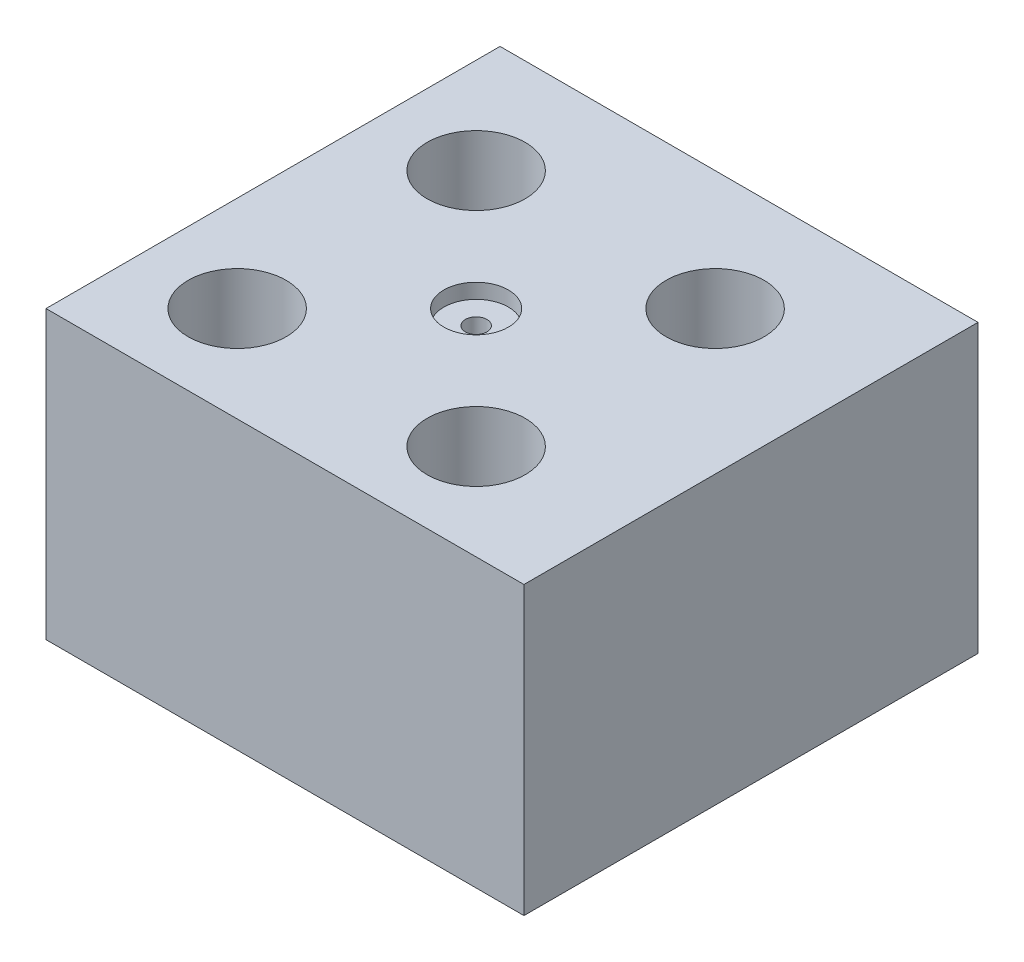
ISO-10303-21;
HEADER;
FILE_DESCRIPTION(('STEP AP214'),'2;1');
FILE_NAME('part.step','',(''),(''),'','','');
FILE_SCHEMA(('AUTOMOTIVE_DESIGN { 1 0 10303 214 1 1 1 1 }'));
ENDSEC;
DATA;
#1=APPLICATION_CONTEXT('core data for automotive mechanical design processes');
#2=APPLICATION_PROTOCOL_DEFINITION('international standard','automotive_design',2000,#1);
#3=PRODUCT_CONTEXT('',#1,'mechanical');
#4=PRODUCT('Part','Part','',(#3));
#5=PRODUCT_RELATED_PRODUCT_CATEGORY('part','',(#4));
#6=PRODUCT_DEFINITION_FORMATION('','',#4);
#7=PRODUCT_DEFINITION_CONTEXT('part definition',#1,'design');
#8=PRODUCT_DEFINITION('design','',#6,#7);
#9=PRODUCT_DEFINITION_SHAPE('','',#8);
#10=(LENGTH_UNIT() NAMED_UNIT(*) SI_UNIT(.MILLI.,.METRE.));
#11=(NAMED_UNIT(*) PLANE_ANGLE_UNIT() SI_UNIT($,.RADIAN.));
#12=(NAMED_UNIT(*) SI_UNIT($,.STERADIAN.) SOLID_ANGLE_UNIT());
#13=UNCERTAINTY_MEASURE_WITH_UNIT(LENGTH_MEASURE(1.E-05),#10,'distance_accuracy_value','');
#14=(GEOMETRIC_REPRESENTATION_CONTEXT(3) GLOBAL_UNCERTAINTY_ASSIGNED_CONTEXT((#13)) GLOBAL_UNIT_ASSIGNED_CONTEXT((#10,
#11,#12)) REPRESENTATION_CONTEXT('',''));
#15=CARTESIAN_POINT('',(0.,0.,0.));
#16=DIRECTION('',(0.,0.,1.));
#17=DIRECTION('',(1.,0.,0.));
#18=AXIS2_PLACEMENT_3D('',#15,#16,#17);
#19=CARTESIAN_POINT('',(0.,30.,0.));
#20=DIRECTION('',(0.,1.,0.));
#21=DIRECTION('',(0.,0.,1.));
#22=AXIS2_PLACEMENT_3D('',#19,#20,#21);
#23=PLANE('',#22);
#24=CARTESIAN_POINT('',(322.5,30.,-22.5));
#25=DIRECTION('',(0.,1.,0.));
#26=DIRECTION('',(0.,0.,1.));
#27=AXIS2_PLACEMENT_3D('',#24,#25,#26);
#28=CIRCLE('',#27,3.37312000000001);
#29=CARTESIAN_POINT('',(322.5,30.,-19.12688));
#30=VERTEX_POINT('',#29);
#31=EDGE_CURVE('E103',#30,#30,#28,.T.);
#32=ORIENTED_EDGE('',*,*,#31,.F.);
#33=EDGE_LOOP('',(#32));
#34=FACE_BOUND('',#33,.T.);
#35=CARTESIAN_POINT('',(335.,30.,-10.));
#36=DIRECTION('',(0.,1.,0.));
#37=DIRECTION('',(0.,0.,1.));
#38=AXIS2_PLACEMENT_3D('',#35,#36,#37);
#39=CIRCLE('',#38,5.12499999999999);
#40=CARTESIAN_POINT('',(335.,30.,-4.87500000000002));
#41=VERTEX_POINT('',#40);
#42=EDGE_CURVE('E162',#41,#41,#39,.T.);
#43=ORIENTED_EDGE('',*,*,#42,.F.);
#44=EDGE_LOOP('',(#43));
#45=FACE_BOUND('',#44,.T.);
#46=CARTESIAN_POINT('',(310.,30.,-10.));
#47=DIRECTION('',(0.,1.,0.));
#48=DIRECTION('',(0.,0.,1.));
#49=AXIS2_PLACEMENT_3D('',#46,#47,#48);
#50=CIRCLE('',#49,5.12499999999999);
#51=CARTESIAN_POINT('',(310.,30.,-4.87500000000002));
#52=VERTEX_POINT('',#51);
#53=EDGE_CURVE('E161',#52,#52,#50,.T.);
#54=ORIENTED_EDGE('',*,*,#53,.F.);
#55=EDGE_LOOP('',(#54));
#56=FACE_BOUND('',#55,.T.);
#57=CARTESIAN_POINT('',(335.,30.,-35.));
#58=DIRECTION('',(0.,1.,0.));
#59=DIRECTION('',(0.,0.,1.));
#60=AXIS2_PLACEMENT_3D('',#57,#58,#59);
#61=CIRCLE('',#60,5.12499999999999);
#62=CARTESIAN_POINT('',(335.,30.,-29.875));
#63=VERTEX_POINT('',#62);
#64=EDGE_CURVE('E166',#63,#63,#61,.T.);
#65=ORIENTED_EDGE('',*,*,#64,.F.);
#66=EDGE_LOOP('',(#65));
#67=FACE_BOUND('',#66,.T.);
#68=CARTESIAN_POINT('',(310.,30.,-35.));
#69=DIRECTION('',(0.,1.,0.));
#70=DIRECTION('',(0.,0.,1.));
#71=AXIS2_PLACEMENT_3D('',#68,#69,#70);
#72=CIRCLE('',#71,5.12499999999999);
#73=CARTESIAN_POINT('',(310.,30.,-29.875));
#74=VERTEX_POINT('',#73);
#75=EDGE_CURVE('E170',#74,#74,#72,.T.);
#76=ORIENTED_EDGE('',*,*,#75,.F.);
#77=EDGE_LOOP('',(#76));
#78=FACE_BOUND('',#77,.T.);
#79=DIRECTION('',(-1.,0.,0.));
#80=VECTOR('',#79,1.);
#81=CARTESIAN_POINT('',(0.,30.,-47.5));
#82=LINE('',#81,#80);
#83=CARTESIAN_POINT('',(350.,30.,-47.5));
#84=VERTEX_POINT('',#83);
#85=CARTESIAN_POINT('',(300.,30.,-47.5));
#86=VERTEX_POINT('',#85);
#87=EDGE_CURVE('E189',#84,#86,#82,.T.);
#88=ORIENTED_EDGE('',*,*,#87,.T.);
#89=DIRECTION('',(0.,0.,1.));
#90=VECTOR('',#89,1.);
#91=CARTESIAN_POINT('',(300.,30.,0.));
#92=LINE('',#91,#90);
#93=CARTESIAN_POINT('',(300.,30.,0.));
#94=VERTEX_POINT('',#93);
#95=EDGE_CURVE('E115',#86,#94,#92,.T.);
#96=ORIENTED_EDGE('',*,*,#95,.T.);
#97=DIRECTION('',(1.,0.,0.));
#98=VECTOR('',#97,1.);
#99=CARTESIAN_POINT('',(350.000000000001,30.,0.));
#100=LINE('',#99,#98);
#101=CARTESIAN_POINT('',(350.000000000001,30.,0.));
#102=VERTEX_POINT('',#101);
#103=EDGE_CURVE('E155',#94,#102,#100,.T.);
#104=ORIENTED_EDGE('',*,*,#103,.T.);
#105=DIRECTION('',(0.,0.,-1.));
#106=VECTOR('',#105,1.);
#107=CARTESIAN_POINT('',(350.000000000001,30.,0.));
#108=LINE('',#107,#106);
#109=EDGE_CURVE('E176',#102,#84,#108,.T.);
#110=ORIENTED_EDGE('',*,*,#109,.T.);
#111=EDGE_LOOP('',(#88,#96,#104,#110));
#112=FACE_BOUND('',#111,.T.);
#113=ADVANCED_FACE('F99',(#34,#45,#56,#67,#78,#112),#23,.T.);
#114=CARTESIAN_POINT('',(0.,0.,0.));
#115=DIRECTION('',(0.,1.,0.));
#116=DIRECTION('',(0.,0.,1.));
#117=AXIS2_PLACEMENT_3D('',#114,#115,#116);
#118=PLANE('',#117);
#119=CARTESIAN_POINT('',(322.5,0.,-22.5));
#120=DIRECTION('',(0.,-1.,0.));
#121=DIRECTION('',(0.,0.,-1.));
#122=AXIS2_PLACEMENT_3D('',#119,#120,#121);
#123=CIRCLE('',#122,1.13029999999997);
#124=CARTESIAN_POINT('',(322.5,0.,-23.6303));
#125=VERTEX_POINT('',#124);
#126=EDGE_CURVE('E198',#125,#125,#123,.T.);
#127=ORIENTED_EDGE('',*,*,#126,.F.);
#128=EDGE_LOOP('',(#127));
#129=FACE_BOUND('',#128,.T.);
#130=CARTESIAN_POINT('',(335.,0.,-10.));
#131=DIRECTION('',(0.,1.,0.));
#132=DIRECTION('',(0.,0.,1.));
#133=AXIS2_PLACEMENT_3D('',#130,#131,#132);
#134=CIRCLE('',#133,5.12499999999999);
#135=CARTESIAN_POINT('',(335.,0.,-4.87500000000002));
#136=VERTEX_POINT('',#135);
#137=EDGE_CURVE('E158',#136,#136,#134,.T.);
#138=ORIENTED_EDGE('',*,*,#137,.T.);
#139=EDGE_LOOP('',(#138));
#140=FACE_BOUND('',#139,.T.);
#141=CARTESIAN_POINT('',(310.,0.,-10.));
#142=DIRECTION('',(0.,1.,0.));
#143=DIRECTION('',(0.,0.,1.));
#144=AXIS2_PLACEMENT_3D('',#141,#142,#143);
#145=CIRCLE('',#144,5.12499999999999);
#146=CARTESIAN_POINT('',(310.,0.,-4.87500000000002));
#147=VERTEX_POINT('',#146);
#148=EDGE_CURVE('E163',#147,#147,#145,.T.);
#149=ORIENTED_EDGE('',*,*,#148,.T.);
#150=EDGE_LOOP('',(#149));
#151=FACE_BOUND('',#150,.T.);
#152=CARTESIAN_POINT('',(335.,0.,-35.));
#153=DIRECTION('',(0.,1.,0.));
#154=DIRECTION('',(0.,0.,1.));
#155=AXIS2_PLACEMENT_3D('',#152,#153,#154);
#156=CIRCLE('',#155,5.12499999999999);
#157=CARTESIAN_POINT('',(335.,0.,-29.875));
#158=VERTEX_POINT('',#157);
#159=EDGE_CURVE('E167',#158,#158,#156,.T.);
#160=ORIENTED_EDGE('',*,*,#159,.T.);
#161=EDGE_LOOP('',(#160));
#162=FACE_BOUND('',#161,.T.);
#163=CARTESIAN_POINT('',(310.,0.,-35.));
#164=DIRECTION('',(0.,1.,0.));
#165=DIRECTION('',(0.,0.,1.));
#166=AXIS2_PLACEMENT_3D('',#163,#164,#165);
#167=CIRCLE('',#166,5.12499999999999);
#168=CARTESIAN_POINT('',(310.,0.,-29.875));
#169=VERTEX_POINT('',#168);
#170=EDGE_CURVE('E171',#169,#169,#167,.T.);
#171=ORIENTED_EDGE('',*,*,#170,.T.);
#172=EDGE_LOOP('',(#171));
#173=FACE_BOUND('',#172,.T.);
#174=DIRECTION('',(0.,0.,1.));
#175=VECTOR('',#174,1.);
#176=CARTESIAN_POINT('',(300.,0.,0.));
#177=LINE('',#176,#175);
#178=CARTESIAN_POINT('',(300.,0.,-47.5));
#179=VERTEX_POINT('',#178);
#180=CARTESIAN_POINT('',(300.,0.,0.));
#181=VERTEX_POINT('',#180);
#182=EDGE_CURVE('E140',#179,#181,#177,.T.);
#183=ORIENTED_EDGE('',*,*,#182,.F.);
#184=DIRECTION('',(-1.,0.,0.));
#185=VECTOR('',#184,1.);
#186=CARTESIAN_POINT('',(0.,0.,-47.5));
#187=LINE('',#186,#185);
#188=CARTESIAN_POINT('',(350.000000000001,0.,-47.5));
#189=VERTEX_POINT('',#188);
#190=EDGE_CURVE('E108',#189,#179,#187,.T.);
#191=ORIENTED_EDGE('',*,*,#190,.F.);
#192=DIRECTION('',(0.,0.,-1.));
#193=VECTOR('',#192,1.);
#194=CARTESIAN_POINT('',(350.000000000001,0.,0.));
#195=LINE('',#194,#193);
#196=CARTESIAN_POINT('',(350.000000000001,0.,0.));
#197=VERTEX_POINT('',#196);
#198=EDGE_CURVE('E173',#197,#189,#195,.T.);
#199=ORIENTED_EDGE('',*,*,#198,.F.);
#200=DIRECTION('',(1.,0.,0.));
#201=VECTOR('',#200,1.);
#202=CARTESIAN_POINT('',(350.000000000001,0.,0.));
#203=LINE('',#202,#201);
#204=EDGE_CURVE('E148',#181,#197,#203,.T.);
#205=ORIENTED_EDGE('',*,*,#204,.F.);
#206=EDGE_LOOP('',(#183,#191,#199,#205));
#207=FACE_BOUND('',#206,.T.);
#208=ADVANCED_FACE('F145',(#129,#140,#151,#162,#173,#207),#118,.F.);
#209=CARTESIAN_POINT('',(350.000000000001,30.,0.));
#210=DIRECTION('',(0.,0.,-1.));
#211=DIRECTION('',(-1.,0.,0.));
#212=AXIS2_PLACEMENT_3D('',#209,#210,#211);
#213=PLANE('',#212);
#214=DIRECTION('',(0.,-1.,0.));
#215=VECTOR('',#214,1.);
#216=CARTESIAN_POINT('',(300.,70.,0.));
#217=LINE('',#216,#215);
#218=EDGE_CURVE('E149',#94,#181,#217,.T.);
#219=ORIENTED_EDGE('',*,*,#218,.T.);
#220=ORIENTED_EDGE('',*,*,#204,.T.);
#221=DIRECTION('',(0.,-1.,0.));
#222=VECTOR('',#221,1.);
#223=CARTESIAN_POINT('',(350.000000000001,30.,0.));
#224=LINE('',#223,#222);
#225=EDGE_CURVE('E152',#102,#197,#224,.T.);
#226=ORIENTED_EDGE('',*,*,#225,.F.);
#227=ORIENTED_EDGE('',*,*,#103,.F.);
#228=EDGE_LOOP('',(#219,#220,#226,#227));
#229=FACE_BOUND('',#228,.T.);
#230=ADVANCED_FACE('F224',(#229),#213,.F.);
#231=CARTESIAN_POINT('',(350.,50.,-47.5));
#232=DIRECTION('',(0.,0.,-1.));
#233=DIRECTION('',(-1.,0.,0.));
#234=AXIS2_PLACEMENT_3D('',#231,#232,#233);
#235=PLANE('',#234);
#236=ORIENTED_EDGE('',*,*,#190,.T.);
#237=DIRECTION('',(0.,1.,0.));
#238=VECTOR('',#237,1.);
#239=CARTESIAN_POINT('',(300.,50.,-47.5));
#240=LINE('',#239,#238);
#241=EDGE_CURVE('E12',#179,#86,#240,.T.);
#242=ORIENTED_EDGE('',*,*,#241,.T.);
#243=ORIENTED_EDGE('',*,*,#87,.F.);
#244=DIRECTION('',(0.,-1.,0.));
#245=VECTOR('',#244,1.);
#246=CARTESIAN_POINT('',(350.,50.,-47.5));
#247=LINE('',#246,#245);
#248=EDGE_CURVE('E122',#84,#189,#247,.T.);
#249=ORIENTED_EDGE('',*,*,#248,.T.);
#250=EDGE_LOOP('',(#236,#242,#243,#249));
#251=FACE_BOUND('',#250,.T.);
#252=ADVANCED_FACE('F151',(#251),#235,.T.);
#253=CARTESIAN_POINT('',(350.000000000001,30.,0.));
#254=DIRECTION('',(-1.,0.,0.));
#255=DIRECTION('',(0.,0.,1.));
#256=AXIS2_PLACEMENT_3D('',#253,#254,#255);
#257=PLANE('',#256);
#258=ORIENTED_EDGE('',*,*,#248,.F.);
#259=ORIENTED_EDGE('',*,*,#109,.F.);
#260=ORIENTED_EDGE('',*,*,#225,.T.);
#261=ORIENTED_EDGE('',*,*,#198,.T.);
#262=EDGE_LOOP('',(#258,#259,#260,#261));
#263=FACE_BOUND('',#262,.T.);
#264=ADVANCED_FACE('F101',(#263),#257,.F.);
#265=CARTESIAN_POINT('',(310.,30.,-35.));
#266=DIRECTION('',(0.,1.,0.));
#267=DIRECTION('',(0.,0.,1.));
#268=AXIS2_PLACEMENT_3D('',#265,#266,#267);
#269=CYLINDRICAL_SURFACE('',#268,5.12499999999999);
#270=ORIENTED_EDGE('',*,*,#75,.T.);
#271=EDGE_LOOP('',(#270));
#272=FACE_BOUND('',#271,.T.);
#273=ORIENTED_EDGE('',*,*,#170,.F.);
#274=EDGE_LOOP('',(#273));
#275=FACE_BOUND('',#274,.T.);
#276=ADVANCED_FACE('F234',(#272,#275),#269,.F.);
#277=CARTESIAN_POINT('',(335.,30.,-35.));
#278=DIRECTION('',(0.,1.,0.));
#279=DIRECTION('',(0.,0.,1.));
#280=AXIS2_PLACEMENT_3D('',#277,#278,#279);
#281=CYLINDRICAL_SURFACE('',#280,5.12499999999999);
#282=ORIENTED_EDGE('',*,*,#64,.T.);
#283=EDGE_LOOP('',(#282));
#284=FACE_BOUND('',#283,.T.);
#285=ORIENTED_EDGE('',*,*,#159,.F.);
#286=EDGE_LOOP('',(#285));
#287=FACE_BOUND('',#286,.T.);
#288=ADVANCED_FACE('F236',(#284,#287),#281,.F.);
#289=CARTESIAN_POINT('',(310.,30.,-10.));
#290=DIRECTION('',(0.,1.,0.));
#291=DIRECTION('',(0.,0.,1.));
#292=AXIS2_PLACEMENT_3D('',#289,#290,#291);
#293=CYLINDRICAL_SURFACE('',#292,5.12499999999999);
#294=ORIENTED_EDGE('',*,*,#53,.T.);
#295=EDGE_LOOP('',(#294));
#296=FACE_BOUND('',#295,.T.);
#297=ORIENTED_EDGE('',*,*,#148,.F.);
#298=EDGE_LOOP('',(#297));
#299=FACE_BOUND('',#298,.T.);
#300=ADVANCED_FACE('F243',(#296,#299),#293,.F.);
#301=CARTESIAN_POINT('',(335.,30.,-10.));
#302=DIRECTION('',(0.,1.,0.));
#303=DIRECTION('',(0.,0.,1.));
#304=AXIS2_PLACEMENT_3D('',#301,#302,#303);
#305=CYLINDRICAL_SURFACE('',#304,5.12499999999999);
#306=ORIENTED_EDGE('',*,*,#42,.T.);
#307=EDGE_LOOP('',(#306));
#308=FACE_BOUND('',#307,.T.);
#309=ORIENTED_EDGE('',*,*,#137,.F.);
#310=EDGE_LOOP('',(#309));
#311=FACE_BOUND('',#310,.T.);
#312=ADVANCED_FACE('F268',(#308,#311),#305,.F.);
#313=CARTESIAN_POINT('',(300.,70.,0.));
#314=DIRECTION('',(-1.,0.,0.));
#315=DIRECTION('',(0.,0.,1.));
#316=AXIS2_PLACEMENT_3D('',#313,#314,#315);
#317=PLANE('',#316);
#318=ORIENTED_EDGE('',*,*,#241,.F.);
#319=ORIENTED_EDGE('',*,*,#182,.T.);
#320=ORIENTED_EDGE('',*,*,#218,.F.);
#321=ORIENTED_EDGE('',*,*,#95,.F.);
#322=EDGE_LOOP('',(#318,#319,#320,#321));
#323=FACE_BOUND('',#322,.T.);
#324=ADVANCED_FACE('F139',(#323),#317,.T.);
#325=CARTESIAN_POINT('',(322.5,0.,-22.5));
#326=DIRECTION('',(0.,-1.,0.));
#327=DIRECTION('',(0.,0.,-1.));
#328=AXIS2_PLACEMENT_3D('',#325,#326,#327);
#329=CYLINDRICAL_SURFACE('',#328,1.13029999999997);
#330=CARTESIAN_POINT('',(322.5,28.448,-22.5));
#331=DIRECTION('',(0.,-1.,0.));
#332=DIRECTION('',(0.,0.,-1.));
#333=AXIS2_PLACEMENT_3D('',#330,#331,#332);
#334=CIRCLE('',#333,1.13029999999997);
#335=CARTESIAN_POINT('',(322.5,28.448,-23.6303));
#336=VERTEX_POINT('',#335);
#337=EDGE_CURVE('E201',#336,#336,#334,.T.);
#338=ORIENTED_EDGE('',*,*,#337,.F.);
#339=EDGE_LOOP('',(#338));
#340=FACE_BOUND('',#339,.T.);
#341=ORIENTED_EDGE('',*,*,#126,.T.);
#342=EDGE_LOOP('',(#341));
#343=FACE_BOUND('',#342,.T.);
#344=ADVANCED_FACE('F213',(#340,#343),#329,.F.);
#345=CARTESIAN_POINT('',(323.6303,28.448,-22.5));
#346=DIRECTION('',(0.,-1.,0.));
#347=DIRECTION('',(0.,0.,-1.));
#348=AXIS2_PLACEMENT_3D('',#345,#346,#347);
#349=PLANE('',#348);
#350=CARTESIAN_POINT('',(322.5,28.448,-22.5));
#351=DIRECTION('',(0.,-1.,0.));
#352=DIRECTION('',(0.,0.,-1.));
#353=AXIS2_PLACEMENT_3D('',#350,#351,#352);
#354=CIRCLE('',#353,3.37312000000001);
#355=CARTESIAN_POINT('',(322.5,28.448,-25.87312));
#356=VERTEX_POINT('',#355);
#357=EDGE_CURVE('E204',#356,#356,#354,.T.);
#358=ORIENTED_EDGE('',*,*,#357,.F.);
#359=EDGE_LOOP('',(#358));
#360=FACE_BOUND('',#359,.T.);
#361=ORIENTED_EDGE('',*,*,#337,.T.);
#362=EDGE_LOOP('',(#361));
#363=FACE_BOUND('',#362,.T.);
#364=ADVANCED_FACE('F210',(#360,#363),#349,.F.);
#365=CARTESIAN_POINT('',(322.5,0.,-22.5));
#366=DIRECTION('',(0.,-1.,0.));
#367=DIRECTION('',(0.,0.,-1.));
#368=AXIS2_PLACEMENT_3D('',#365,#366,#367);
#369=CYLINDRICAL_SURFACE('',#368,3.37312000000001);
#370=ORIENTED_EDGE('',*,*,#31,.T.);
#371=EDGE_LOOP('',(#370));
#372=FACE_BOUND('',#371,.T.);
#373=ORIENTED_EDGE('',*,*,#357,.T.);
#374=EDGE_LOOP('',(#373));
#375=FACE_BOUND('',#374,.T.);
#376=ADVANCED_FACE('F208',(#372,#375),#369,.F.);
#377=CLOSED_SHELL('',(#113,#208,#230,#252,#264,#276,#288,#300,#312,#324,#344,#364,#376));
#378=MANIFOLD_SOLID_BREP('B2',#377);
#379=ADVANCED_BREP_SHAPE_REPRESENTATION('',(#18,#378),#14);
#380=SHAPE_DEFINITION_REPRESENTATION(#9,#379);
ENDSEC;
END-ISO-10303-21;
